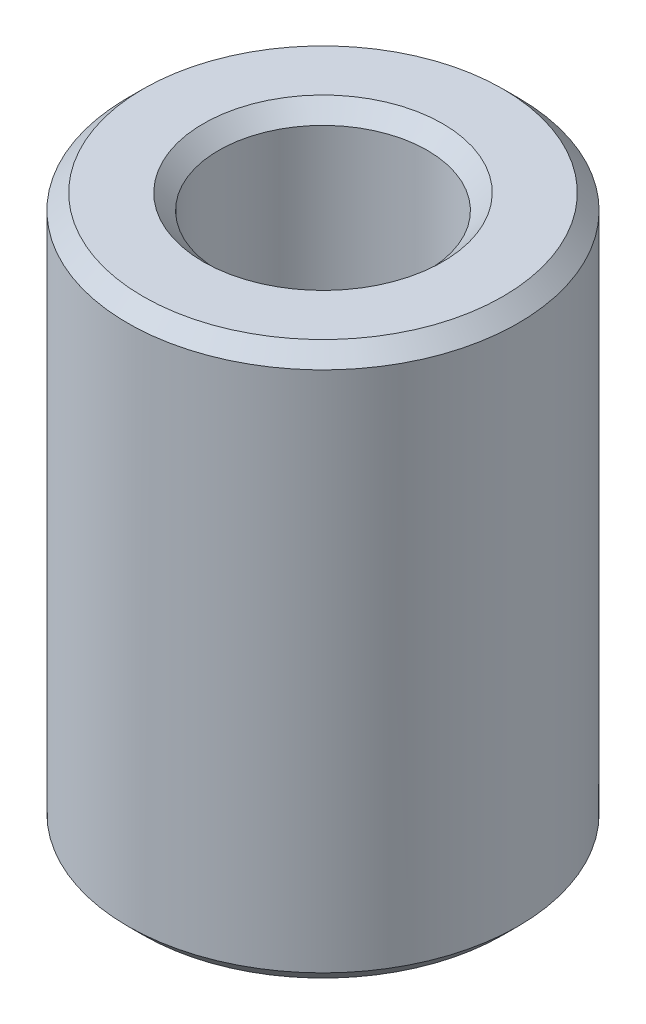
ISO-10303-21;
HEADER;
FILE_DESCRIPTION(('STEP AP214'),'2;1');
FILE_NAME('part.step','',(''),(''),'','','');
FILE_SCHEMA(('AUTOMOTIVE_DESIGN { 1 0 10303 214 1 1 1 1 }'));
ENDSEC;
DATA;
#1=APPLICATION_CONTEXT('core data for automotive mechanical design processes');
#2=APPLICATION_PROTOCOL_DEFINITION('international standard','automotive_design',2000,#1);
#3=PRODUCT_CONTEXT('',#1,'mechanical');
#4=PRODUCT('Part','Part','',(#3));
#5=PRODUCT_RELATED_PRODUCT_CATEGORY('part','',(#4));
#6=PRODUCT_DEFINITION_FORMATION('','',#4);
#7=PRODUCT_DEFINITION_CONTEXT('part definition',#1,'design');
#8=PRODUCT_DEFINITION('design','',#6,#7);
#9=PRODUCT_DEFINITION_SHAPE('','',#8);
#10=(LENGTH_UNIT() NAMED_UNIT(*) SI_UNIT(.MILLI.,.METRE.));
#11=(NAMED_UNIT(*) PLANE_ANGLE_UNIT() SI_UNIT($,.RADIAN.));
#12=(NAMED_UNIT(*) SI_UNIT($,.STERADIAN.) SOLID_ANGLE_UNIT());
#13=UNCERTAINTY_MEASURE_WITH_UNIT(LENGTH_MEASURE(1.E-05),#10,'distance_accuracy_value','');
#14=(GEOMETRIC_REPRESENTATION_CONTEXT(3) GLOBAL_UNCERTAINTY_ASSIGNED_CONTEXT((#13)) GLOBAL_UNIT_ASSIGNED_CONTEXT((#10,
#11,#12)) REPRESENTATION_CONTEXT('',''));
#15=CARTESIAN_POINT('',(0.,0.,0.));
#16=DIRECTION('',(0.,0.,1.));
#17=DIRECTION('',(1.,0.,0.));
#18=AXIS2_PLACEMENT_3D('',#15,#16,#17);
#19=CARTESIAN_POINT('',(0.,127.457256159419,0.));
#20=DIRECTION('',(0.,-1.,0.));
#21=DIRECTION('',(0.,0.,-1.));
#22=AXIS2_PLACEMENT_3D('',#19,#20,#21);
#23=CYLINDRICAL_SURFACE('',#22,45.);
#24=CARTESIAN_POINT('',(0.,3.54896504500055,0.));
#25=DIRECTION('',(0.,1.,0.));
#26=DIRECTION('',(0.,0.,1.));
#27=AXIS2_PLACEMENT_3D('',#24,#25,#26);
#28=CIRCLE('',#27,45.);
#29=CARTESIAN_POINT('',(0.,3.54896504500055,45.));
#30=VERTEX_POINT('',#29);
#31=EDGE_CURVE('E10',#30,#30,#28,.T.);
#32=ORIENTED_EDGE('',*,*,#31,.T.);
#33=EDGE_LOOP('',(#32));
#34=FACE_BOUND('',#33,.T.);
#35=CARTESIAN_POINT('',(0.,123.908291114418,0.));
#36=DIRECTION('',(0.,1.,0.));
#37=DIRECTION('',(0.,0.,1.));
#38=AXIS2_PLACEMENT_3D('',#35,#36,#37);
#39=CIRCLE('',#38,45.);
#40=CARTESIAN_POINT('',(0.,123.908291114418,-45.));
#41=VERTEX_POINT('',#40);
#42=EDGE_CURVE('E50',#41,#41,#39,.F.);
#43=ORIENTED_EDGE('',*,*,#42,.T.);
#44=EDGE_LOOP('',(#43));
#45=FACE_BOUND('',#44,.T.);
#46=ADVANCED_FACE('F39',(#34,#45),#23,.T.);
#47=CARTESIAN_POINT('',(0.,127.457256159419,0.));
#48=DIRECTION('',(0.,1.,0.));
#49=DIRECTION('',(0.,0.,1.));
#50=AXIS2_PLACEMENT_3D('',#47,#48,#49);
#51=PLANE('',#50);
#52=CARTESIAN_POINT('',(0.,127.457256159419,0.));
#53=DIRECTION('',(0.,1.,0.));
#54=DIRECTION('',(0.,0.,1.));
#55=AXIS2_PLACEMENT_3D('',#52,#53,#54);
#56=CIRCLE('',#55,27.5855391898171);
#57=CARTESIAN_POINT('',(0.,127.457256159419,27.5855391898171));
#58=VERTEX_POINT('',#57);
#59=EDGE_CURVE('E58',#58,#58,#56,.F.);
#60=ORIENTED_EDGE('',*,*,#59,.T.);
#61=EDGE_LOOP('',(#60));
#62=FACE_BOUND('',#61,.T.);
#63=CARTESIAN_POINT('',(0.,127.457256159419,0.));
#64=DIRECTION('',(0.,1.,0.));
#65=DIRECTION('',(0.,0.,1.));
#66=AXIS2_PLACEMENT_3D('',#63,#64,#65);
#67=CIRCLE('',#66,41.4510349549994);
#68=CARTESIAN_POINT('',(0.,127.457256159419,-41.4510349549994));
#69=VERTEX_POINT('',#68);
#70=EDGE_CURVE('E61',#69,#69,#67,.T.);
#71=ORIENTED_EDGE('',*,*,#70,.T.);
#72=EDGE_LOOP('',(#71));
#73=FACE_BOUND('',#72,.T.);
#74=ADVANCED_FACE('F88',(#62,#73),#51,.T.);
#75=CARTESIAN_POINT('',(0.,0.,0.));
#76=DIRECTION('',(0.,1.,0.));
#77=DIRECTION('',(0.,0.,1.));
#78=AXIS2_PLACEMENT_3D('',#75,#76,#77);
#79=PLANE('',#78);
#80=CARTESIAN_POINT('',(0.,0.,0.));
#81=DIRECTION('',(0.,1.,0.));
#82=DIRECTION('',(0.,0.,1.));
#83=AXIS2_PLACEMENT_3D('',#80,#81,#82);
#84=CIRCLE('',#83,27.5855391898171);
#85=CARTESIAN_POINT('',(0.,0.,-27.5855391898171));
#86=VERTEX_POINT('',#85);
#87=EDGE_CURVE('E51',#86,#86,#84,.T.);
#88=ORIENTED_EDGE('',*,*,#87,.T.);
#89=EDGE_LOOP('',(#88));
#90=FACE_BOUND('',#89,.T.);
#91=CARTESIAN_POINT('',(0.,0.,0.));
#92=DIRECTION('',(0.,1.,0.));
#93=DIRECTION('',(0.,0.,1.));
#94=AXIS2_PLACEMENT_3D('',#91,#92,#93);
#95=CIRCLE('',#94,41.4510349549994);
#96=CARTESIAN_POINT('',(0.,0.,41.4510349549994));
#97=VERTEX_POINT('',#96);
#98=EDGE_CURVE('E54',#97,#97,#95,.F.);
#99=ORIENTED_EDGE('',*,*,#98,.T.);
#100=EDGE_LOOP('',(#99));
#101=FACE_BOUND('',#100,.T.);
#102=ADVANCED_FACE('F83',(#90,#101),#79,.F.);
#103=CARTESIAN_POINT('',(0.,127.457256159419,0.));
#104=DIRECTION('',(0.,-1.,0.));
#105=DIRECTION('',(0.,0.,-1.));
#106=AXIS2_PLACEMENT_3D('',#103,#104,#105);
#107=CYLINDRICAL_SURFACE('',#106,24.0365741448165);
#108=CARTESIAN_POINT('',(0.,123.908291114418,0.));
#109=DIRECTION('',(0.,1.,0.));
#110=DIRECTION('',(0.,0.,1.));
#111=AXIS2_PLACEMENT_3D('',#108,#109,#110);
#112=CIRCLE('',#111,24.0365741448165);
#113=CARTESIAN_POINT('',(0.,123.908291114418,24.0365741448165));
#114=VERTEX_POINT('',#113);
#115=EDGE_CURVE('E67',#114,#114,#112,.T.);
#116=ORIENTED_EDGE('',*,*,#115,.T.);
#117=EDGE_LOOP('',(#116));
#118=FACE_BOUND('',#117,.T.);
#119=CARTESIAN_POINT('',(0.,3.54896504500066,0.));
#120=DIRECTION('',(0.,1.,0.));
#121=DIRECTION('',(0.,0.,1.));
#122=AXIS2_PLACEMENT_3D('',#119,#120,#121);
#123=CIRCLE('',#122,24.0365741448165);
#124=CARTESIAN_POINT('',(0.,3.54896504500066,-24.0365741448165));
#125=VERTEX_POINT('',#124);
#126=EDGE_CURVE('E69',#125,#125,#123,.F.);
#127=ORIENTED_EDGE('',*,*,#126,.T.);
#128=EDGE_LOOP('',(#127));
#129=FACE_BOUND('',#128,.T.);
#130=ADVANCED_FACE('F71',(#118,#129),#107,.F.);
#131=CARTESIAN_POINT('',(0.,123.908291114418,0.));
#132=DIRECTION('',(0.,1.,0.));
#133=DIRECTION('',(0.,0.,1.));
#134=AXIS2_PLACEMENT_3D('',#131,#132,#133);
#135=CONICAL_SURFACE('',#134,24.0365741448165,0.785398163397448);
#136=ORIENTED_EDGE('',*,*,#59,.F.);
#137=EDGE_LOOP('',(#136));
#138=FACE_BOUND('',#137,.T.);
#139=ORIENTED_EDGE('',*,*,#115,.F.);
#140=EDGE_LOOP('',(#139));
#141=FACE_BOUND('',#140,.T.);
#142=ADVANCED_FACE('F77',(#138,#141),#135,.F.);
#143=CARTESIAN_POINT('',(0.,0.,0.));
#144=DIRECTION('',(0.,-1.,0.));
#145=DIRECTION('',(0.,0.,-1.));
#146=AXIS2_PLACEMENT_3D('',#143,#144,#145);
#147=CONICAL_SURFACE('',#146,27.5855391898171,0.785398163397444);
#148=CARTESIAN_POINT('',(0.,3.54896504500066,-24.0365741448165));
#149=CARTESIAN_POINT('',(0.,3.51199665911523,-24.0735425307019));
#150=CARTESIAN_POINT('',(0.,3.47502827322981,-24.1105109165873));
#151=CARTESIAN_POINT('',(0.,3.40109150145896,-24.1844476883582));
#152=CARTESIAN_POINT('',(0.,3.36412311557354,-24.2214160742436));
#153=CARTESIAN_POINT('',(0.,3.29018634380269,-24.2953528460145));
#154=CARTESIAN_POINT('',(0.,3.25321795791727,-24.3323212318999));
#155=CARTESIAN_POINT('',(0.,3.17928118614642,-24.4062580036707));
#156=CARTESIAN_POINT('',(0.,3.142312800261,-24.4432263895562));
#157=CARTESIAN_POINT('',(0.,3.06837602849015,-24.517163161327));
#158=CARTESIAN_POINT('',(0.,3.03140764260473,-24.5541315472124));
#159=CARTESIAN_POINT('',(0.,2.95747087083388,-24.6280683189833));
#160=CARTESIAN_POINT('',(0.,2.92050248494846,-24.6650367048687));
#161=CARTESIAN_POINT('',(0.,2.84656571317761,-24.7389734766395));
#162=CARTESIAN_POINT('',(0.,2.80959732729219,-24.775941862525));
#163=CARTESIAN_POINT('',(0.,2.73566055552134,-24.8498786342958));
#164=CARTESIAN_POINT('',(0.,2.69869216963592,-24.8868470201812));
#165=CARTESIAN_POINT('',(0.,2.62475539786507,-24.9607837919521));
#166=CARTESIAN_POINT('',(0.,2.58778701197965,-24.9977521778375));
#167=CARTESIAN_POINT('',(0.,2.5138502402088,-25.0716889496083));
#168=CARTESIAN_POINT('',(0.,2.47688185432337,-25.1086573354938));
#169=CARTESIAN_POINT('',(0.,2.40294508255253,-25.1825941072646));
#170=CARTESIAN_POINT('',(0.,2.3659766966671,-25.21956249315));
#171=CARTESIAN_POINT('',(0.,2.29203992489626,-25.2934992649209));
#172=CARTESIAN_POINT('',(0.,2.25507153901083,-25.3304676508063));
#173=CARTESIAN_POINT('',(0.,2.18113476723999,-25.4044044225772));
#174=CARTESIAN_POINT('',(0.,2.14416638135456,-25.4413728084626));
#175=CARTESIAN_POINT('',(0.,2.07022960958372,-25.5153095802334));
#176=CARTESIAN_POINT('',(0.,2.03326122369829,-25.5522779661189));
#177=CARTESIAN_POINT('',(0.,1.95932445192745,-25.6262147378897));
#178=CARTESIAN_POINT('',(0.,1.92235606604202,-25.6631831237751));
#179=CARTESIAN_POINT('',(0.,1.84841929427118,-25.737119895546));
#180=CARTESIAN_POINT('',(0.,1.81145090838575,-25.7740882814314));
#181=CARTESIAN_POINT('',(0.,1.7375141366149,-25.8480250532022));
#182=CARTESIAN_POINT('',(0.,1.70054575072948,-25.8849934390877));
#183=CARTESIAN_POINT('',(0.,1.62660897895863,-25.9589302108585));
#184=CARTESIAN_POINT('',(0.,1.58964059307321,-25.9958985967439));
#185=CARTESIAN_POINT('',(0.,1.51570382130236,-26.0698353685148));
#186=CARTESIAN_POINT('',(0.,1.47873543541694,-26.1068037544002));
#187=CARTESIAN_POINT('',(0.,1.40479866364609,-26.180740526171));
#188=CARTESIAN_POINT('',(0.,1.36783027776067,-26.2177089120565));
#189=CARTESIAN_POINT('',(0.,1.29389350598982,-26.2916456838273));
#190=CARTESIAN_POINT('',(0.,1.2569251201044,-26.3286140697127));
#191=CARTESIAN_POINT('',(0.,1.18298834833355,-26.4025508414836));
#192=CARTESIAN_POINT('',(0.,1.14601996244813,-26.439519227369));
#193=CARTESIAN_POINT('',(0.,1.07208319067728,-26.5134559991399));
#194=CARTESIAN_POINT('',(0.,1.03511480479186,-26.5504243850253));
#195=CARTESIAN_POINT('',(0.,0.961178033021011,-26.6243611567961));
#196=CARTESIAN_POINT('',(0.,0.924209647135588,-26.6613295426815));
#197=CARTESIAN_POINT('',(0.,0.850272875364741,-26.7352663144524));
#198=CARTESIAN_POINT('',(0.,0.813304489479317,-26.7722347003378));
#199=CARTESIAN_POINT('',(0.,0.73936771770847,-26.8461714721087));
#200=CARTESIAN_POINT('',(0.,0.702399331823047,-26.8831398579941));
#201=CARTESIAN_POINT('',(0.,0.628462560052199,-26.9570766297649));
#202=CARTESIAN_POINT('',(0.,0.591494174166776,-26.9940450156504));
#203=CARTESIAN_POINT('',(0.,0.517557402395929,-27.0679817874212));
#204=CARTESIAN_POINT('',(0.,0.480589016510505,-27.1049501733066));
#205=CARTESIAN_POINT('',(0.,0.406652244739659,-27.1788869450775));
#206=CARTESIAN_POINT('',(0.,0.369683858854235,-27.2158553309629));
#207=CARTESIAN_POINT('',(0.,0.295747087083388,-27.2897921027337));
#208=CARTESIAN_POINT('',(0.,0.258778701197964,-27.3267604886192));
#209=CARTESIAN_POINT('',(0.,0.184841929427117,-27.40069726039));
#210=CARTESIAN_POINT('',(0.,0.147873543541694,-27.4376656462754));
#211=CARTESIAN_POINT('',(0.,0.0739367717708476,-27.5116024180463));
#212=CARTESIAN_POINT('',(0.,0.0369683858854244,-27.5485708039317));
#213=CARTESIAN_POINT('',(0.,0.,-27.5855391898171));
#214=B_SPLINE_CURVE_WITH_KNOTS('',3,(#148,#149,#150,#151,#152,#153,#154,#155,#156,#157,#158,
#159,#160,#161,#162,#163,#164,#165,#166,#167,#168,#169,#170,#171,#172,#173,#174,#175,#176,#177,
#178,#179,#180,#181,#182,#183,#184,#185,#186,#187,#188,#189,#190,#191,#192,#193,#194,#195,#196,
#197,#198,#199,#200,#201,#202,#203,#204,#205,#206,#207,#208,#209,#210,#211,#212,#213),
.UNSPECIFIED.,.F.,.F.,(4,2,2,2,2,2,2,2,2,2,2,2,2,2,2,2,2,2,2,2,2,2,2,2,2,2,2,2,2,2,2,2,4),(0.,
0.156843578094625,0.313687156189247,0.470530734283869,0.627374312378494,0.784217890473119,
0.941061468567741,1.09790504666236,1.25474862475699,1.41159220285161,1.56843578094624,
1.72527935904086,1.88212293713548,2.03896651523011,2.19581009332473,2.35265367141935,
2.50949724951398,2.6663408276086,2.82318440570322,2.98002798379784,3.13687156189247,
3.29371513998709,3.45055871808172,3.60740229617634,3.76424587427096,3.92108945236559,
4.07793303046021,4.23477660855483,4.39162018664946,4.54846376474408,4.7053073428387,
4.86215092093333,5.01899449902795),.UNSPECIFIED.);
#215=EDGE_CURVE('BSEAM73',#125,#86,#214,.T.);
#216=ORIENTED_EDGE('',*,*,#126,.F.);
#217=ORIENTED_EDGE('',*,*,#87,.F.);
#218=ORIENTED_EDGE('',*,*,#215,.T.);
#219=ORIENTED_EDGE('',*,*,#215,.F.);
#220=EDGE_LOOP('',(#216,#218,#217,#219));
#221=FACE_BOUND('',#220,.T.);
#222=ADVANCED_FACE('F73',(#221),#147,.F.);
#223=CARTESIAN_POINT('',(0.,3.54896504500055,0.));
#224=DIRECTION('',(0.,1.,0.));
#225=DIRECTION('',(0.,0.,1.));
#226=AXIS2_PLACEMENT_3D('',#223,#224,#225);
#227=CONICAL_SURFACE('',#226,45.,0.785398163397454);
#228=ORIENTED_EDGE('',*,*,#98,.F.);
#229=EDGE_LOOP('',(#228));
#230=FACE_BOUND('',#229,.T.);
#231=ORIENTED_EDGE('',*,*,#31,.F.);
#232=EDGE_LOOP('',(#231));
#233=FACE_BOUND('',#232,.T.);
#234=ADVANCED_FACE('F76',(#230,#233),#227,.T.);
#235=CARTESIAN_POINT('',(0.,127.457256159419,0.));
#236=DIRECTION('',(0.,-1.,0.));
#237=DIRECTION('',(0.,0.,-1.));
#238=AXIS2_PLACEMENT_3D('',#235,#236,#237);
#239=CONICAL_SURFACE('',#238,41.4510349549994,0.785398163397443);
#240=CARTESIAN_POINT('',(0.,123.908291114418,-45.));
#241=CARTESIAN_POINT('',(0.,123.945259500304,-44.9630316141146));
#242=CARTESIAN_POINT('',(0.,123.982227886189,-44.9260632282292));
#243=CARTESIAN_POINT('',(0.,124.05616465796,-44.8521264564583));
#244=CARTESIAN_POINT('',(0.,124.093133043845,-44.8151580705729));
#245=CARTESIAN_POINT('',(0.,124.167069815616,-44.7412212988021));
#246=CARTESIAN_POINT('',(0.,124.204038201502,-44.7042529129166));
#247=CARTESIAN_POINT('',(0.,124.277974973272,-44.6303161411458));
#248=CARTESIAN_POINT('',(0.,124.314943359158,-44.5933477552604));
#249=CARTESIAN_POINT('',(0.,124.388880130929,-44.5194109834895));
#250=CARTESIAN_POINT('',(0.,124.425848516814,-44.4824425976041));
#251=CARTESIAN_POINT('',(0.,124.499785288585,-44.4085058258332));
#252=CARTESIAN_POINT('',(0.,124.53675367447,-44.3715374399478));
#253=CARTESIAN_POINT('',(0.,124.610690446241,-44.297600668177));
#254=CARTESIAN_POINT('',(0.,124.647658832127,-44.2606322822916));
#255=CARTESIAN_POINT('',(0.,124.721595603898,-44.1866955105207));
#256=CARTESIAN_POINT('',(0.,124.758563989783,-44.1497271246353));
#257=CARTESIAN_POINT('',(0.,124.832500761554,-44.0757903528644));
#258=CARTESIAN_POINT('',(0.,124.869469147439,-44.038821966979));
#259=CARTESIAN_POINT('',(0.,124.94340591921,-43.9648851952082));
#260=CARTESIAN_POINT('',(0.,124.980374305095,-43.9279168093227));
#261=CARTESIAN_POINT('',(0.,125.054311076866,-43.8539800375519));
#262=CARTESIAN_POINT('',(0.,125.091279462752,-43.8170116516665));
#263=CARTESIAN_POINT('',(0.,125.165216234523,-43.7430748798956));
#264=CARTESIAN_POINT('',(0.,125.202184620408,-43.7061064940102));
#265=CARTESIAN_POINT('',(0.,125.276121392179,-43.6321697222394));
#266=CARTESIAN_POINT('',(0.,125.313089778064,-43.5952013363539));
#267=CARTESIAN_POINT('',(0.,125.387026549835,-43.5212645645831));
#268=CARTESIAN_POINT('',(0.,125.423994935721,-43.4842961786977));
#269=CARTESIAN_POINT('',(0.,125.497931707491,-43.4103594069268));
#270=CARTESIAN_POINT('',(0.,125.534900093377,-43.3733910210414));
#271=CARTESIAN_POINT('',(0.,125.608836865148,-43.2994542492705));
#272=CARTESIAN_POINT('',(0.,125.645805251033,-43.2624858633851));
#273=CARTESIAN_POINT('',(0.,125.719742022804,-43.1885490916143));
#274=CARTESIAN_POINT('',(0.,125.756710408689,-43.1515807057289));
#275=CARTESIAN_POINT('',(0.,125.83064718046,-43.077643933958));
#276=CARTESIAN_POINT('',(0.,125.867615566346,-43.0406755480726));
#277=CARTESIAN_POINT('',(0.,125.941552338116,-42.9667387763017));
#278=CARTESIAN_POINT('',(0.,125.978520724002,-42.9297703904163));
#279=CARTESIAN_POINT('',(0.,126.052457495773,-42.8558336186455));
#280=CARTESIAN_POINT('',(0.,126.089425881658,-42.8188652327601));
#281=CARTESIAN_POINT('',(0.,126.163362653429,-42.7449284609892));
#282=CARTESIAN_POINT('',(0.,126.200331039314,-42.7079600751038));
#283=CARTESIAN_POINT('',(0.,126.274267811085,-42.6340233033329));
#284=CARTESIAN_POINT('',(0.,126.311236196971,-42.5970549174475));
#285=CARTESIAN_POINT('',(0.,126.385172968742,-42.5231181456767));
#286=CARTESIAN_POINT('',(0.,126.422141354627,-42.4861497597912));
#287=CARTESIAN_POINT('',(0.,126.496078126398,-42.4122129880204));
#288=CARTESIAN_POINT('',(0.,126.533046512283,-42.375244602135));
#289=CARTESIAN_POINT('',(0.,126.606983284054,-42.3013078303641));
#290=CARTESIAN_POINT('',(0.,126.64395166994,-42.2643394444787));
#291=CARTESIAN_POINT('',(0.,126.71788844171,-42.1904026727079));
#292=CARTESIAN_POINT('',(0.,126.754856827596,-42.1534342868224));
#293=CARTESIAN_POINT('',(0.,126.828793599367,-42.0794975150516));
#294=CARTESIAN_POINT('',(0.,126.865761985252,-42.0425291291662));
#295=CARTESIAN_POINT('',(0.,126.939698757023,-41.9685923573953));
#296=CARTESIAN_POINT('',(0.,126.976667142908,-41.9316239715099));
#297=CARTESIAN_POINT('',(0.,127.050603914679,-41.857687199739));
#298=CARTESIAN_POINT('',(0.,127.087572300565,-41.8207188138536));
#299=CARTESIAN_POINT('',(0.,127.161509072335,-41.7467820420828));
#300=CARTESIAN_POINT('',(0.,127.198477458221,-41.7098136561974));
#301=CARTESIAN_POINT('',(0.,127.272414229992,-41.6358768844265));
#302=CARTESIAN_POINT('',(0.,127.309382615877,-41.5989084985411));
#303=CARTESIAN_POINT('',(0.,127.383319387648,-41.5249717267702));
#304=CARTESIAN_POINT('',(0.,127.420287773533,-41.4880033408848));
#305=CARTESIAN_POINT('',(0.,127.457256159419,-41.4510349549994));
#306=B_SPLINE_CURVE_WITH_KNOTS('',3,(#240,#241,#242,#243,#244,#245,#246,#247,#248,#249,#250,
#251,#252,#253,#254,#255,#256,#257,#258,#259,#260,#261,#262,#263,#264,#265,#266,#267,#268,#269,
#270,#271,#272,#273,#274,#275,#276,#277,#278,#279,#280,#281,#282,#283,#284,#285,#286,#287,#288,
#289,#290,#291,#292,#293,#294,#295,#296,#297,#298,#299,#300,#301,#302,#303,#304,#305),
.UNSPECIFIED.,.F.,.F.,(4,2,2,2,2,2,2,2,2,2,2,2,2,2,2,2,2,2,2,2,2,2,2,2,2,2,2,2,2,2,2,2,4),(0.,
0.156843578094625,0.313687156189246,0.470530734283871,0.627374312378496,0.784217890473117,
0.941061468567742,1.09790504666237,1.25474862475699,1.41159220285161,1.56843578094623,
1.72527935904085,1.88212293713547,2.0389665152301,2.19581009332473,2.35265367141935,
2.50949724951397,2.6663408276086,2.82318440570322,2.98002798379784,3.13687156189247,
3.29371513998709,3.45055871808171,3.60740229617634,3.76424587427096,3.92108945236559,
4.07793303046021,4.23477660855484,4.39162018664946,4.54846376474408,4.70530734283871,
4.86215092093333,5.01899449902795),.UNSPECIFIED.);
#307=EDGE_CURVE('BSEAM45',#41,#69,#306,.T.);
#308=ORIENTED_EDGE('',*,*,#42,.F.);
#309=ORIENTED_EDGE('',*,*,#70,.F.);
#310=ORIENTED_EDGE('',*,*,#307,.T.);
#311=ORIENTED_EDGE('',*,*,#307,.F.);
#312=EDGE_LOOP('',(#308,#310,#309,#311));
#313=FACE_BOUND('',#312,.T.);
#314=ADVANCED_FACE('F45',(#313),#239,.T.);
#315=CLOSED_SHELL('',(#46,#74,#102,#130,#142,#222,#234,#314));
#316=MANIFOLD_SOLID_BREP('B2',#315);
#317=ADVANCED_BREP_SHAPE_REPRESENTATION('',(#18,#316),#14);
#318=SHAPE_DEFINITION_REPRESENTATION(#9,#317);
ENDSEC;
END-ISO-10303-21;
